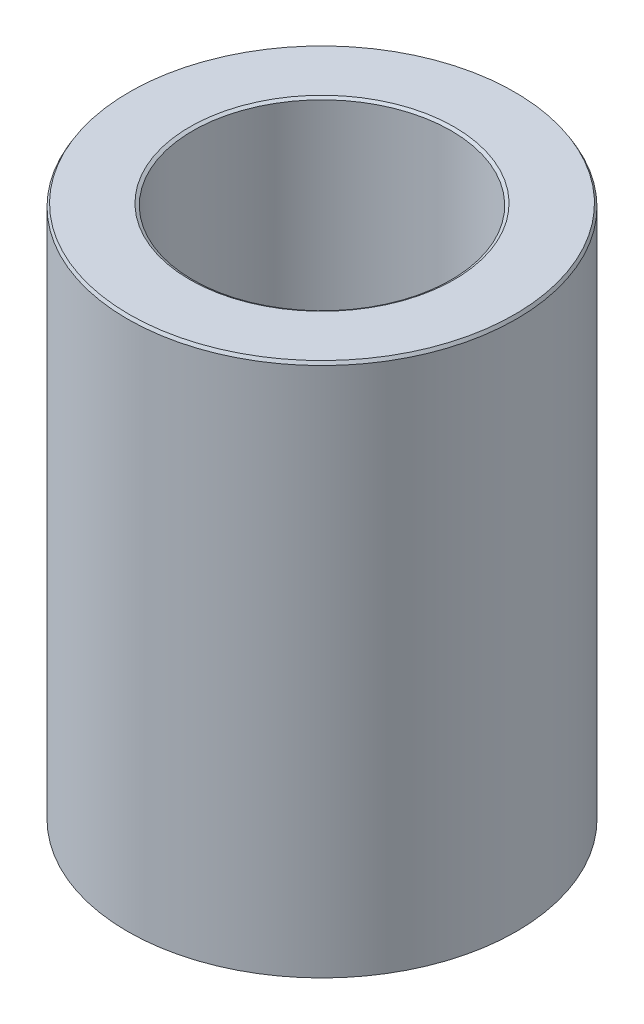
ISO-10303-21;
HEADER;
FILE_DESCRIPTION(('STEP AP214'),'2;1');
FILE_NAME('part.step','',(''),(''),'','','');
FILE_SCHEMA(('AUTOMOTIVE_DESIGN { 1 0 10303 214 1 1 1 1 }'));
ENDSEC;
DATA;
#1=APPLICATION_CONTEXT('core data for automotive mechanical design processes');
#2=APPLICATION_PROTOCOL_DEFINITION('international standard','automotive_design',2000,#1);
#3=PRODUCT_CONTEXT('',#1,'mechanical');
#4=PRODUCT('Part','Part','',(#3));
#5=PRODUCT_RELATED_PRODUCT_CATEGORY('part','',(#4));
#6=PRODUCT_DEFINITION_FORMATION('','',#4);
#7=PRODUCT_DEFINITION_CONTEXT('part definition',#1,'design');
#8=PRODUCT_DEFINITION('design','',#6,#7);
#9=PRODUCT_DEFINITION_SHAPE('','',#8);
#10=(LENGTH_UNIT() NAMED_UNIT(*) SI_UNIT(.MILLI.,.METRE.));
#11=(NAMED_UNIT(*) PLANE_ANGLE_UNIT() SI_UNIT($,.RADIAN.));
#12=(NAMED_UNIT(*) SI_UNIT($,.STERADIAN.) SOLID_ANGLE_UNIT());
#13=UNCERTAINTY_MEASURE_WITH_UNIT(LENGTH_MEASURE(1.E-05),#10,'distance_accuracy_value','');
#14=(GEOMETRIC_REPRESENTATION_CONTEXT(3) GLOBAL_UNCERTAINTY_ASSIGNED_CONTEXT((#13)) GLOBAL_UNIT_ASSIGNED_CONTEXT((#10,
#11,#12)) REPRESENTATION_CONTEXT('',''));
#15=CARTESIAN_POINT('',(0.,0.,0.));
#16=DIRECTION('',(0.,0.,1.));
#17=DIRECTION('',(1.,0.,0.));
#18=AXIS2_PLACEMENT_3D('',#15,#16,#17);
#19=CARTESIAN_POINT('',(0.,158.263329586551,0.));
#20=DIRECTION('',(0.,-1.,0.));
#21=DIRECTION('',(0.,0.,-1.));
#22=AXIS2_PLACEMENT_3D('',#19,#20,#21);
#23=CYLINDRICAL_SURFACE('',#22,57.5);
#24=CARTESIAN_POINT('',(0.,0.524061589056712,0.));
#25=DIRECTION('',(0.,1.,0.));
#26=DIRECTION('',(0.,0.,1.));
#27=AXIS2_PLACEMENT_3D('',#24,#25,#26);
#28=CIRCLE('',#27,57.5);
#29=CARTESIAN_POINT('',(0.,0.524061589056712,57.5));
#30=VERTEX_POINT('',#29);
#31=EDGE_CURVE('E10',#30,#30,#28,.T.);
#32=ORIENTED_EDGE('',*,*,#31,.T.);
#33=EDGE_LOOP('',(#32));
#34=FACE_BOUND('',#33,.T.);
#35=CARTESIAN_POINT('',(0.,157.35562828801,0.));
#36=DIRECTION('',(0.,1.,0.));
#37=DIRECTION('',(0.,0.,1.));
#38=AXIS2_PLACEMENT_3D('',#35,#36,#37);
#39=CIRCLE('',#38,57.5);
#40=CARTESIAN_POINT('',(0.,157.35562828801,57.5));
#41=VERTEX_POINT('',#40);
#42=EDGE_CURVE('E50',#41,#41,#39,.F.);
#43=ORIENTED_EDGE('',*,*,#42,.T.);
#44=EDGE_LOOP('',(#43));
#45=FACE_BOUND('',#44,.T.);
#46=ADVANCED_FACE('F39',(#34,#45),#23,.T.);
#47=CARTESIAN_POINT('',(0.,158.263329586551,0.));
#48=DIRECTION('',(0.,1.,0.));
#49=DIRECTION('',(0.,0.,1.));
#50=AXIS2_PLACEMENT_3D('',#47,#48,#49);
#51=PLANE('',#50);
#52=CARTESIAN_POINT('',(0.,158.263329586551,0.));
#53=DIRECTION('',(0.,1.,0.));
#54=DIRECTION('',(0.,0.,1.));
#55=AXIS2_PLACEMENT_3D('',#52,#53,#54);
#56=CIRCLE('',#55,39.1146072567468);
#57=CARTESIAN_POINT('',(0.,158.263329586551,39.1146072567468));
#58=VERTEX_POINT('',#57);
#59=EDGE_CURVE('E58',#58,#58,#56,.F.);
#60=ORIENTED_EDGE('',*,*,#59,.T.);
#61=EDGE_LOOP('',(#60));
#62=FACE_BOUND('',#61,.T.);
#63=CARTESIAN_POINT('',(0.,158.263329586551,0.));
#64=DIRECTION('',(0.,1.,0.));
#65=DIRECTION('',(0.,0.,1.));
#66=AXIS2_PLACEMENT_3D('',#63,#64,#65);
#67=CIRCLE('',#66,56.9759384109433);
#68=CARTESIAN_POINT('',(0.,158.263329586551,56.9759384109433));
#69=VERTEX_POINT('',#68);
#70=EDGE_CURVE('E61',#69,#69,#67,.T.);
#71=ORIENTED_EDGE('',*,*,#70,.T.);
#72=EDGE_LOOP('',(#71));
#73=FACE_BOUND('',#72,.T.);
#74=ADVANCED_FACE('F88',(#62,#73),#51,.T.);
#75=CARTESIAN_POINT('',(0.,0.,0.));
#76=DIRECTION('',(0.,1.,0.));
#77=DIRECTION('',(0.,0.,1.));
#78=AXIS2_PLACEMENT_3D('',#75,#76,#77);
#79=PLANE('',#78);
#80=CARTESIAN_POINT('',(0.,0.,0.));
#81=DIRECTION('',(0.,1.,0.));
#82=DIRECTION('',(0.,0.,1.));
#83=AXIS2_PLACEMENT_3D('',#80,#81,#82);
#84=CIRCLE('',#83,38.730967547262);
#85=CARTESIAN_POINT('',(0.,0.,-38.730967547262));
#86=VERTEX_POINT('',#85);
#87=EDGE_CURVE('E51',#86,#86,#84,.T.);
#88=ORIENTED_EDGE('',*,*,#87,.T.);
#89=EDGE_LOOP('',(#88));
#90=FACE_BOUND('',#89,.T.);
#91=CARTESIAN_POINT('',(0.,0.,0.));
#92=DIRECTION('',(0.,1.,0.));
#93=DIRECTION('',(0.,0.,1.));
#94=AXIS2_PLACEMENT_3D('',#91,#92,#93);
#95=CIRCLE('',#94,56.5922987014585);
#96=CARTESIAN_POINT('',(0.,0.,56.5922987014585));
#97=VERTEX_POINT('',#96);
#98=EDGE_CURVE('E54',#97,#97,#95,.F.);
#99=ORIENTED_EDGE('',*,*,#98,.T.);
#100=EDGE_LOOP('',(#99));
#101=FACE_BOUND('',#100,.T.);
#102=ADVANCED_FACE('F83',(#90,#101),#79,.F.);
#103=CARTESIAN_POINT('',(0.,158.263329586551,0.));
#104=DIRECTION('',(0.,-1.,0.));
#105=DIRECTION('',(0.,0.,-1.));
#106=AXIS2_PLACEMENT_3D('',#103,#104,#105);
#107=CYLINDRICAL_SURFACE('',#106,38.2069059582053);
#108=CARTESIAN_POINT('',(0.,157.739267997495,0.));
#109=DIRECTION('',(0.,1.,0.));
#110=DIRECTION('',(0.,0.,1.));
#111=AXIS2_PLACEMENT_3D('',#108,#109,#110);
#112=CIRCLE('',#111,38.2069059582053);
#113=CARTESIAN_POINT('',(0.,157.739267997495,38.2069059582053));
#114=VERTEX_POINT('',#113);
#115=EDGE_CURVE('E67',#114,#114,#112,.T.);
#116=ORIENTED_EDGE('',*,*,#115,.T.);
#117=EDGE_LOOP('',(#116));
#118=FACE_BOUND('',#117,.T.);
#119=CARTESIAN_POINT('',(0.,0.907701298541452,0.));
#120=DIRECTION('',(0.,1.,0.));
#121=DIRECTION('',(0.,0.,1.));
#122=AXIS2_PLACEMENT_3D('',#119,#120,#121);
#123=CIRCLE('',#122,38.2069059582053);
#124=CARTESIAN_POINT('',(0.,0.907701298541452,-38.2069059582053));
#125=VERTEX_POINT('',#124);
#126=EDGE_CURVE('E69',#125,#125,#123,.F.);
#127=ORIENTED_EDGE('',*,*,#126,.T.);
#128=EDGE_LOOP('',(#127));
#129=FACE_BOUND('',#128,.T.);
#130=ADVANCED_FACE('F71',(#118,#129),#107,.F.);
#131=CARTESIAN_POINT('',(0.,157.739267997495,0.));
#132=DIRECTION('',(0.,1.,0.));
#133=DIRECTION('',(0.,0.,1.));
#134=AXIS2_PLACEMENT_3D('',#131,#132,#133);
#135=CONICAL_SURFACE('',#134,38.2069059582053,1.04719755119661);
#136=ORIENTED_EDGE('',*,*,#59,.F.);
#137=EDGE_LOOP('',(#136));
#138=FACE_BOUND('',#137,.T.);
#139=ORIENTED_EDGE('',*,*,#115,.F.);
#140=EDGE_LOOP('',(#139));
#141=FACE_BOUND('',#140,.T.);
#142=ADVANCED_FACE('F77',(#138,#141),#135,.F.);
#143=CARTESIAN_POINT('',(0.,0.,0.));
#144=DIRECTION('',(0.,-1.,0.));
#145=DIRECTION('',(0.,0.,-1.));
#146=AXIS2_PLACEMENT_3D('',#143,#144,#145);
#147=CONICAL_SURFACE('',#146,38.730967547262,0.523598775598308);
#148=CARTESIAN_POINT('',(0.,0.907701298541452,-38.2069059582053));
#149=CARTESIAN_POINT('',(0.,0.898246076681645,-38.2123649330913));
#150=CARTESIAN_POINT('',(0.,0.888790854821839,-38.2178239079773));
#151=CARTESIAN_POINT('',(0.,0.869880411102225,-38.2287418577494));
#152=CARTESIAN_POINT('',(0.,0.860425189242418,-38.2342008326354));
#153=CARTESIAN_POINT('',(0.,0.841514745522805,-38.2451187824074));
#154=CARTESIAN_POINT('',(0.,0.832059523662998,-38.2505777572934));
#155=CARTESIAN_POINT('',(0.,0.813149079943384,-38.2614957070654));
#156=CARTESIAN_POINT('',(0.,0.803693858083577,-38.2669546819514));
#157=CARTESIAN_POINT('',(0.,0.784783414363964,-38.2778726317234));
#158=CARTESIAN_POINT('',(0.,0.775328192504158,-38.2833316066094));
#159=CARTESIAN_POINT('',(0.,0.756417748784544,-38.2942495563814));
#160=CARTESIAN_POINT('',(0.,0.746962526924736,-38.2997085312674));
#161=CARTESIAN_POINT('',(0.,0.728052083205122,-38.3106264810395));
#162=CARTESIAN_POINT('',(0.,0.718596861345316,-38.3160854559255));
#163=CARTESIAN_POINT('',(0.,0.699686417625703,-38.3270034056975));
#164=CARTESIAN_POINT('',(0.,0.690231195765896,-38.3324623805835));
#165=CARTESIAN_POINT('',(0.,0.671320752046282,-38.3433803303555));
#166=CARTESIAN_POINT('',(0.,0.661865530186476,-38.3488393052415));
#167=CARTESIAN_POINT('',(0.,0.642955086466862,-38.3597572550135));
#168=CARTESIAN_POINT('',(0.,0.633499864607055,-38.3652162298995));
#169=CARTESIAN_POINT('',(0.,0.614589420887442,-38.3761341796715));
#170=CARTESIAN_POINT('',(0.,0.605134199027635,-38.3815931545576));
#171=CARTESIAN_POINT('',(0.,0.586223755308021,-38.3925111043296));
#172=CARTESIAN_POINT('',(0.,0.576768533448214,-38.3979700792156));
#173=CARTESIAN_POINT('',(0.,0.557858089728601,-38.4088880289876));
#174=CARTESIAN_POINT('',(0.,0.548402867868794,-38.4143470038736));
#175=CARTESIAN_POINT('',(0.,0.52949242414918,-38.4252649536456));
#176=CARTESIAN_POINT('',(0.,0.520037202289374,-38.4307239285316));
#177=CARTESIAN_POINT('',(0.,0.50112675856976,-38.4416418783036));
#178=CARTESIAN_POINT('',(0.,0.491671536709953,-38.4471008531896));
#179=CARTESIAN_POINT('',(0.,0.47276109299034,-38.4580188029617));
#180=CARTESIAN_POINT('',(0.,0.463305871130534,-38.4634777778477));
#181=CARTESIAN_POINT('',(0.,0.44439542741092,-38.4743957276197));
#182=CARTESIAN_POINT('',(0.,0.434940205551112,-38.4798547025057));
#183=CARTESIAN_POINT('',(0.,0.416029761831498,-38.4907726522777));
#184=CARTESIAN_POINT('',(0.,0.406574539971692,-38.4962316271637));
#185=CARTESIAN_POINT('',(0.,0.387664096252079,-38.5071495769357));
#186=CARTESIAN_POINT('',(0.,0.378208874392272,-38.5126085518217));
#187=CARTESIAN_POINT('',(0.,0.359298430672658,-38.5235265015937));
#188=CARTESIAN_POINT('',(0.,0.349843208812851,-38.5289854764798));
#189=CARTESIAN_POINT('',(0.,0.330932765093238,-38.5399034262518));
#190=CARTESIAN_POINT('',(0.,0.321477543233431,-38.5453624011378));
#191=CARTESIAN_POINT('',(0.,0.302567099513817,-38.5562803509098));
#192=CARTESIAN_POINT('',(0.,0.293111877654011,-38.5617393257958));
#193=CARTESIAN_POINT('',(0.,0.274201433934397,-38.5726572755678));
#194=CARTESIAN_POINT('',(0.,0.26474621207459,-38.5781162504538));
#195=CARTESIAN_POINT('',(0.,0.245835768354977,-38.5890342002258));
#196=CARTESIAN_POINT('',(0.,0.23638054649517,-38.5944931751118));
#197=CARTESIAN_POINT('',(0.,0.217470102775556,-38.6054111248839));
#198=CARTESIAN_POINT('',(0.,0.208014880915749,-38.6108700997699));
#199=CARTESIAN_POINT('',(0.,0.189104437196136,-38.6217880495419));
#200=CARTESIAN_POINT('',(0.,0.17964921533633,-38.6272470244279));
#201=CARTESIAN_POINT('',(0.,0.160738771616716,-38.6381649741999));
#202=CARTESIAN_POINT('',(0.,0.151283549756908,-38.6436239490859));
#203=CARTESIAN_POINT('',(0.,0.132373106037294,-38.6545418988579));
#204=CARTESIAN_POINT('',(0.,0.122917884177488,-38.6600008737439));
#205=CARTESIAN_POINT('',(0.,0.104007440457875,-38.6709188235159));
#206=CARTESIAN_POINT('',(0.,0.094552218598068,-38.6763777984019));
#207=CARTESIAN_POINT('',(0.,0.0756417748784543,-38.687295748174));
#208=CARTESIAN_POINT('',(0.,0.0661865530186475,-38.69275472306));
#209=CARTESIAN_POINT('',(0.,0.047276109299034,-38.703672672832));
#210=CARTESIAN_POINT('',(0.,0.0378208874392272,-38.709131647718));
#211=CARTESIAN_POINT('',(0.,0.0189104437196136,-38.72004959749));
#212=CARTESIAN_POINT('',(0.,0.00945522185980679,-38.725508572376));
#213=CARTESIAN_POINT('',(0.,0.,-38.730967547262));
#214=B_SPLINE_CURVE_WITH_KNOTS('',3,(#148,#149,#150,#151,#152,#153,#154,#155,#156,#157,#158,
#159,#160,#161,#162,#163,#164,#165,#166,#167,#168,#169,#170,#171,#172,#173,#174,#175,#176,#177,
#178,#179,#180,#181,#182,#183,#184,#185,#186,#187,#188,#189,#190,#191,#192,#193,#194,#195,#196,
#197,#198,#199,#200,#201,#202,#203,#204,#205,#206,#207,#208,#209,#210,#211,#212,#213),
.UNSPECIFIED.,.F.,.F.,(4,2,2,2,2,2,2,2,2,2,2,2,2,2,2,2,2,2,2,2,2,2,2,2,2,2,2,2,2,2,2,2,4),(0.,
0.032753849316043,0.065507698632086,0.0982615479481291,0.131015397264172,0.163769246580215,
0.196523095896255,0.229276945212298,0.262030794528341,0.294784643844384,0.327538493160427,
0.36029234247647,0.393046191792513,0.425800041108556,0.458553890424599,0.491307739740642,
0.524061589056685,0.556815438372724,0.589569287688767,0.62232313700481,0.655076986320853,
0.687830835636896,0.720584684952939,0.753338534268982,0.786092383585025,0.818846232901068,
0.851600082217111,0.884353931533151,0.917107780849194,0.949861630165237,0.98261547948128,
1.01536932879732,1.04812317811337),.UNSPECIFIED.);
#215=EDGE_CURVE('BSEAM73',#125,#86,#214,.T.);
#216=ORIENTED_EDGE('',*,*,#126,.F.);
#217=ORIENTED_EDGE('',*,*,#87,.F.);
#218=ORIENTED_EDGE('',*,*,#215,.T.);
#219=ORIENTED_EDGE('',*,*,#215,.F.);
#220=EDGE_LOOP('',(#216,#218,#217,#219));
#221=FACE_BOUND('',#220,.T.);
#222=ADVANCED_FACE('F73',(#221),#147,.F.);
#223=CARTESIAN_POINT('',(0.,0.524061589056712,0.));
#224=DIRECTION('',(0.,1.,0.));
#225=DIRECTION('',(0.,0.,1.));
#226=AXIS2_PLACEMENT_3D('',#223,#224,#225);
#227=CONICAL_SURFACE('',#226,57.5,1.04719755119659);
#228=ORIENTED_EDGE('',*,*,#98,.F.);
#229=EDGE_LOOP('',(#228));
#230=FACE_BOUND('',#229,.T.);
#231=ORIENTED_EDGE('',*,*,#31,.F.);
#232=EDGE_LOOP('',(#231));
#233=FACE_BOUND('',#232,.T.);
#234=ADVANCED_FACE('F76',(#230,#233),#227,.T.);
#235=CARTESIAN_POINT('',(0.,158.263329586551,0.));
#236=DIRECTION('',(0.,-1.,0.));
#237=DIRECTION('',(0.,0.,-1.));
#238=AXIS2_PLACEMENT_3D('',#235,#236,#237);
#239=CONICAL_SURFACE('',#238,56.9759384109433,0.523598775598316);
#240=ORIENTED_EDGE('',*,*,#42,.F.);
#241=EDGE_LOOP('',(#240));
#242=FACE_BOUND('',#241,.T.);
#243=ORIENTED_EDGE('',*,*,#70,.F.);
#244=EDGE_LOOP('',(#243));
#245=FACE_BOUND('',#244,.T.);
#246=ADVANCED_FACE('F45',(#242,#245),#239,.T.);
#247=CLOSED_SHELL('',(#46,#74,#102,#130,#142,#222,#234,#246));
#248=MANIFOLD_SOLID_BREP('B2',#247);
#249=ADVANCED_BREP_SHAPE_REPRESENTATION('',(#18,#248),#14);
#250=SHAPE_DEFINITION_REPRESENTATION(#9,#249);
ENDSEC;
END-ISO-10303-21;
